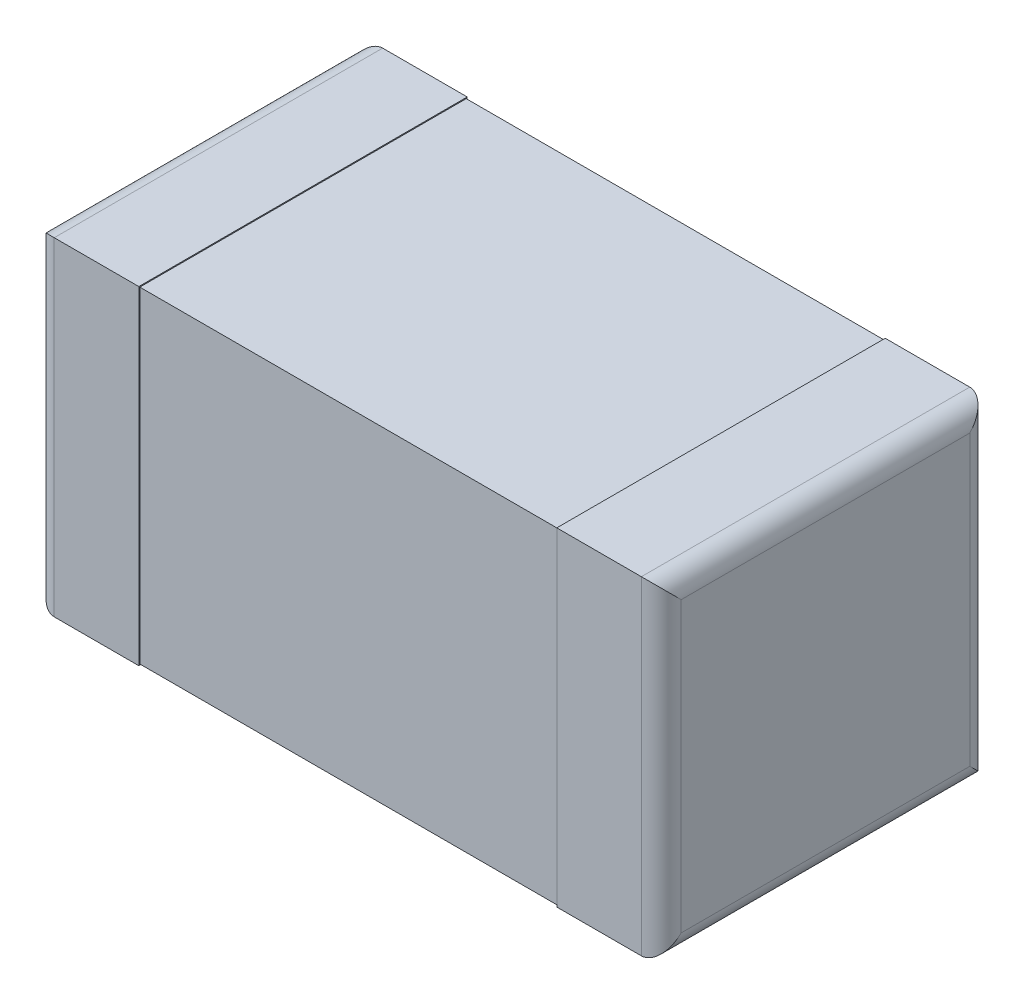
ISO-10303-21;
HEADER;
FILE_DESCRIPTION(('STEP AP214'),'2;1');
FILE_NAME('part.step','',(''),(''),'','','');
FILE_SCHEMA(('AUTOMOTIVE_DESIGN { 1 0 10303 214 1 1 1 1 }'));
ENDSEC;
DATA;
#1=APPLICATION_CONTEXT('core data for automotive mechanical design processes');
#2=APPLICATION_PROTOCOL_DEFINITION('international standard','automotive_design',2000,#1);
#3=PRODUCT_CONTEXT('',#1,'mechanical');
#4=PRODUCT('Part','Part','',(#3));
#5=PRODUCT_RELATED_PRODUCT_CATEGORY('part','',(#4));
#6=PRODUCT_DEFINITION_FORMATION('','',#4);
#7=PRODUCT_DEFINITION_CONTEXT('part definition',#1,'design');
#8=PRODUCT_DEFINITION('design','',#6,#7);
#9=PRODUCT_DEFINITION_SHAPE('','',#8);
#10=(LENGTH_UNIT() NAMED_UNIT(*) SI_UNIT(.MILLI.,.METRE.));
#11=(NAMED_UNIT(*) PLANE_ANGLE_UNIT() SI_UNIT($,.RADIAN.));
#12=(NAMED_UNIT(*) SI_UNIT($,.STERADIAN.) SOLID_ANGLE_UNIT());
#13=UNCERTAINTY_MEASURE_WITH_UNIT(LENGTH_MEASURE(1.E-05),#10,'distance_accuracy_value','');
#14=(GEOMETRIC_REPRESENTATION_CONTEXT(3) GLOBAL_UNCERTAINTY_ASSIGNED_CONTEXT((#13)) GLOBAL_UNIT_ASSIGNED_CONTEXT((#10,
#11,#12)) REPRESENTATION_CONTEXT('',''));
#15=CARTESIAN_POINT('',(0.,0.,0.));
#16=DIRECTION('',(0.,0.,1.));
#17=DIRECTION('',(1.,0.,0.));
#18=AXIS2_PLACEMENT_3D('',#15,#16,#17);
#19=CARTESIAN_POINT('',(0.,0.8382,0.8382));
#20=DIRECTION('',(1.,0.,0.));
#21=DIRECTION('',(0.,1.,0.));
#22=AXIS2_PLACEMENT_3D('',#19,#20,#21);
#23=PLANE('',#22);
#24=DIRECTION('',(0.,0.,-1.));
#25=VECTOR('',#24,1.);
#26=CARTESIAN_POINT('',(0.,0.0508,0.8382));
#27=LINE('',#26,#25);
#28=CARTESIAN_POINT('',(0.,0.0508,0.7874));
#29=VERTEX_POINT('',#28);
#30=CARTESIAN_POINT('',(0.,0.0508,0.0508));
#31=VERTEX_POINT('',#30);
#32=EDGE_CURVE('E194',#29,#31,#27,.T.);
#33=ORIENTED_EDGE('',*,*,#32,.F.);
#34=DIRECTION('',(0.,1.,0.));
#35=VECTOR('',#34,1.);
#36=CARTESIAN_POINT('',(0.,0.,0.7874));
#37=LINE('',#36,#35);
#38=CARTESIAN_POINT('',(0.,0.7874,0.7874));
#39=VERTEX_POINT('',#38);
#40=EDGE_CURVE('E153',#39,#29,#37,.F.);
#41=ORIENTED_EDGE('',*,*,#40,.F.);
#42=DIRECTION('',(0.,0.,-1.));
#43=VECTOR('',#42,1.);
#44=CARTESIAN_POINT('',(0.,0.7874,0.8382));
#45=LINE('',#44,#43);
#46=CARTESIAN_POINT('',(0.,0.7874,0.0508));
#47=VERTEX_POINT('',#46);
#48=EDGE_CURVE('E150',#47,#39,#45,.F.);
#49=ORIENTED_EDGE('',*,*,#48,.F.);
#50=DIRECTION('',(0.,-1.,0.));
#51=VECTOR('',#50,1.);
#52=CARTESIAN_POINT('',(0.,0.8382,0.0508));
#53=LINE('',#52,#51);
#54=EDGE_CURVE('E192',#31,#47,#53,.F.);
#55=ORIENTED_EDGE('',*,*,#54,.F.);
#56=EDGE_LOOP('',(#33,#41,#49,#55));
#57=FACE_BOUND('',#56,.T.);
#58=ADVANCED_FACE('F16',(#57),#23,.F.);
#59=CARTESIAN_POINT('',(1.6002,0.,0.8382));
#60=DIRECTION('',(-1.,0.,0.));
#61=DIRECTION('',(0.,0.,1.));
#62=AXIS2_PLACEMENT_3D('',#59,#60,#61);
#63=PLANE('',#62);
#64=DIRECTION('',(0.,0.,-1.));
#65=VECTOR('',#64,1.);
#66=CARTESIAN_POINT('',(1.6002,0.7874,0.8382));
#67=LINE('',#66,#65);
#68=CARTESIAN_POINT('',(1.6002,0.7874,0.7874));
#69=VERTEX_POINT('',#68);
#70=CARTESIAN_POINT('',(1.6002,0.7874,0.0508));
#71=VERTEX_POINT('',#70);
#72=EDGE_CURVE('E180',#69,#71,#67,.T.);
#73=ORIENTED_EDGE('',*,*,#72,.F.);
#74=DIRECTION('',(0.,-1.,0.));
#75=VECTOR('',#74,1.);
#76=CARTESIAN_POINT('',(1.6002,0.,0.7874));
#77=LINE('',#76,#75);
#78=CARTESIAN_POINT('',(1.6002,0.0508,0.7874));
#79=VERTEX_POINT('',#78);
#80=EDGE_CURVE('E184',#79,#69,#77,.F.);
#81=ORIENTED_EDGE('',*,*,#80,.F.);
#82=DIRECTION('',(0.,0.,-1.));
#83=VECTOR('',#82,1.);
#84=CARTESIAN_POINT('',(1.6002,0.0508,0.8382));
#85=LINE('',#84,#83);
#86=CARTESIAN_POINT('',(1.6002,0.0508,0.0508));
#87=VERTEX_POINT('',#86);
#88=EDGE_CURVE('E188',#87,#79,#85,.F.);
#89=ORIENTED_EDGE('',*,*,#88,.F.);
#90=DIRECTION('',(0.,1.,0.));
#91=VECTOR('',#90,1.);
#92=CARTESIAN_POINT('',(1.6002,0.,0.0508));
#93=LINE('',#92,#91);
#94=EDGE_CURVE('E137',#71,#87,#93,.F.);
#95=ORIENTED_EDGE('',*,*,#94,.F.);
#96=EDGE_LOOP('',(#73,#81,#89,#95));
#97=FACE_BOUND('',#96,.T.);
#98=ADVANCED_FACE('F381',(#97),#63,.F.);
#99=CARTESIAN_POINT('',(0.0508,0.7874,0.8382));
#100=DIRECTION('',(0.,0.,-1.));
#101=DIRECTION('',(-1.,0.,0.));
#102=AXIS2_PLACEMENT_3D('',#99,#100,#101);
#103=CYLINDRICAL_SURFACE('',#102,0.0508);
#104=CARTESIAN_POINT('',(0.0508,0.7874,0.7874));
#105=DIRECTION('',(0.,0.707106781186547,-0.707106781186547));
#106=DIRECTION('',(0.,0.707106781186547,0.707106781186547));
#107=AXIS2_PLACEMENT_3D('',#104,#105,#106);
#108=ELLIPSE('',#107,0.0718420489685532,0.0508);
#109=CARTESIAN_POINT('',(0.0508,0.8382,0.8382));
#110=VERTEX_POINT('',#109);
#111=EDGE_CURVE('E19',#110,#39,#108,.F.);
#112=ORIENTED_EDGE('',*,*,#111,.F.);
#113=DIRECTION('',(0.,0.,1.));
#114=VECTOR('',#113,1.);
#115=CARTESIAN_POINT('',(0.0507999999999999,0.8382,0.8382));
#116=LINE('',#115,#114);
#117=CARTESIAN_POINT('',(0.0508,0.8382,0.));
#118=VERTEX_POINT('',#117);
#119=EDGE_CURVE('E126',#110,#118,#116,.F.);
#120=ORIENTED_EDGE('',*,*,#119,.T.);
#121=CARTESIAN_POINT('',(0.0508,0.7874,0.0508));
#122=DIRECTION('',(0.,-0.707106781186547,-0.707106781186547));
#123=DIRECTION('',(0.,-0.707106781186547,0.707106781186547));
#124=AXIS2_PLACEMENT_3D('',#121,#122,#123);
#125=ELLIPSE('',#124,0.0718420489685532,0.0508);
#126=EDGE_CURVE('E193',#47,#118,#125,.T.);
#127=ORIENTED_EDGE('',*,*,#126,.F.);
#128=ORIENTED_EDGE('',*,*,#48,.T.);
#129=EDGE_LOOP('',(#112,#120,#127,#128));
#130=FACE_BOUND('',#129,.T.);
#131=ADVANCED_FACE('F149',(#130),#103,.T.);
#132=CARTESIAN_POINT('',(0.0508,0.,0.7874));
#133=DIRECTION('',(0.,1.,0.));
#134=DIRECTION('',(-1.,0.,0.));
#135=AXIS2_PLACEMENT_3D('',#132,#133,#134);
#136=CYLINDRICAL_SURFACE('',#135,0.0508);
#137=CARTESIAN_POINT('',(0.0508,0.0508,0.7874));
#138=DIRECTION('',(0.,-0.707106781186547,-0.707106781186547));
#139=DIRECTION('',(0.,0.707106781186547,-0.707106781186547));
#140=AXIS2_PLACEMENT_3D('',#137,#138,#139);
#141=ELLIPSE('',#140,0.0718420489685532,0.0508);
#142=CARTESIAN_POINT('',(0.0507999999999999,0.,0.8382));
#143=VERTEX_POINT('',#142);
#144=EDGE_CURVE('E156',#143,#29,#141,.T.);
#145=ORIENTED_EDGE('',*,*,#144,.F.);
#146=DIRECTION('',(0.,1.,0.));
#147=VECTOR('',#146,1.);
#148=CARTESIAN_POINT('',(0.0507999999999999,0.,0.8382));
#149=LINE('',#148,#147);
#150=EDGE_CURVE('E143',#110,#143,#149,.F.);
#151=ORIENTED_EDGE('',*,*,#150,.F.);
#152=ORIENTED_EDGE('',*,*,#111,.T.);
#153=ORIENTED_EDGE('',*,*,#40,.T.);
#154=EDGE_LOOP('',(#145,#151,#152,#153));
#155=FACE_BOUND('',#154,.T.);
#156=ADVANCED_FACE('F154',(#155),#136,.T.);
#157=CARTESIAN_POINT('',(0.0508,0.0508,0.8382));
#158=DIRECTION('',(0.,0.,-1.));
#159=DIRECTION('',(-1.,0.,0.));
#160=AXIS2_PLACEMENT_3D('',#157,#158,#159);
#161=CYLINDRICAL_SURFACE('',#160,0.0508);
#162=CARTESIAN_POINT('',(0.0508,0.0508,0.0508));
#163=DIRECTION('',(0.,-0.707106781186547,0.707106781186547));
#164=DIRECTION('',(0.,-0.707106781186547,-0.707106781186547));
#165=AXIS2_PLACEMENT_3D('',#162,#163,#164);
#166=ELLIPSE('',#165,0.0718420489685532,0.0508);
#167=CARTESIAN_POINT('',(0.0508,0.,0.));
#168=VERTEX_POINT('',#167);
#169=EDGE_CURVE('E189',#168,#31,#166,.F.);
#170=ORIENTED_EDGE('',*,*,#169,.F.);
#171=DIRECTION('',(0.,0.,1.));
#172=VECTOR('',#171,1.);
#173=CARTESIAN_POINT('',(0.0508,0.,0.8382));
#174=LINE('',#173,#172);
#175=EDGE_CURVE('E158',#168,#143,#174,.T.);
#176=ORIENTED_EDGE('',*,*,#175,.T.);
#177=ORIENTED_EDGE('',*,*,#144,.T.);
#178=ORIENTED_EDGE('',*,*,#32,.T.);
#179=EDGE_LOOP('',(#170,#176,#177,#178));
#180=FACE_BOUND('',#179,.T.);
#181=ADVANCED_FACE('F374',(#180),#161,.T.);
#182=CARTESIAN_POINT('',(0.0508,0.8382,0.0508));
#183=DIRECTION('',(0.,-1.,0.));
#184=DIRECTION('',(1.,0.,0.));
#185=AXIS2_PLACEMENT_3D('',#182,#183,#184);
#186=CYLINDRICAL_SURFACE('',#185,0.0508);
#187=ORIENTED_EDGE('',*,*,#169,.T.);
#188=ORIENTED_EDGE('',*,*,#54,.T.);
#189=ORIENTED_EDGE('',*,*,#126,.T.);
#190=DIRECTION('',(0.,1.,0.));
#191=VECTOR('',#190,1.);
#192=CARTESIAN_POINT('',(0.0507999999999999,0.,0.));
#193=LINE('',#192,#191);
#194=EDGE_CURVE('E213',#118,#168,#193,.F.);
#195=ORIENTED_EDGE('',*,*,#194,.T.);
#196=EDGE_LOOP('',(#187,#188,#189,#195));
#197=FACE_BOUND('',#196,.T.);
#198=ADVANCED_FACE('F370',(#197),#186,.T.);
#199=CARTESIAN_POINT('',(1.5494,0.0508,0.8382));
#200=DIRECTION('',(0.,0.,-1.));
#201=DIRECTION('',(-1.,0.,0.));
#202=AXIS2_PLACEMENT_3D('',#199,#200,#201);
#203=CYLINDRICAL_SURFACE('',#202,0.0508);
#204=CARTESIAN_POINT('',(1.5494,0.0508,0.7874));
#205=DIRECTION('',(0.,-0.707106781186547,-0.707106781186547));
#206=DIRECTION('',(0.,-0.707106781186547,0.707106781186547));
#207=AXIS2_PLACEMENT_3D('',#204,#205,#206);
#208=ELLIPSE('',#207,0.0718420489685532,0.0508);
#209=CARTESIAN_POINT('',(1.5494,0.,0.8382));
#210=VERTEX_POINT('',#209);
#211=EDGE_CURVE('E185',#210,#79,#208,.F.);
#212=ORIENTED_EDGE('',*,*,#211,.F.);
#213=DIRECTION('',(0.,0.,1.));
#214=VECTOR('',#213,1.);
#215=CARTESIAN_POINT('',(1.5494,0.,0.8382));
#216=LINE('',#215,#214);
#217=CARTESIAN_POINT('',(1.5494,0.,0.));
#218=VERTEX_POINT('',#217);
#219=EDGE_CURVE('E212',#210,#218,#216,.F.);
#220=ORIENTED_EDGE('',*,*,#219,.T.);
#221=CARTESIAN_POINT('',(1.5494,0.0508,0.0508));
#222=DIRECTION('',(0.,0.707106781186547,-0.707106781186547));
#223=DIRECTION('',(0.,0.707106781186547,0.707106781186547));
#224=AXIS2_PLACEMENT_3D('',#221,#222,#223);
#225=ELLIPSE('',#224,0.0718420489685532,0.0508);
#226=EDGE_CURVE('E178',#87,#218,#225,.T.);
#227=ORIENTED_EDGE('',*,*,#226,.F.);
#228=ORIENTED_EDGE('',*,*,#88,.T.);
#229=EDGE_LOOP('',(#212,#220,#227,#228));
#230=FACE_BOUND('',#229,.T.);
#231=ADVANCED_FACE('F366',(#230),#203,.T.);
#232=CARTESIAN_POINT('',(1.5494,0.,0.7874));
#233=DIRECTION('',(0.,-1.,0.));
#234=DIRECTION('',(0.,0.,-1.));
#235=AXIS2_PLACEMENT_3D('',#232,#233,#234);
#236=CYLINDRICAL_SURFACE('',#235,0.0508);
#237=CARTESIAN_POINT('',(1.5494,0.7874,0.7874));
#238=DIRECTION('',(0.,0.707106781186547,-0.707106781186547));
#239=DIRECTION('',(0.,-0.707106781186547,-0.707106781186547));
#240=AXIS2_PLACEMENT_3D('',#237,#238,#239);
#241=ELLIPSE('',#240,0.0718420489685532,0.0508);
#242=CARTESIAN_POINT('',(1.5494,0.8382,0.8382));
#243=VERTEX_POINT('',#242);
#244=EDGE_CURVE('E181',#243,#69,#241,.T.);
#245=ORIENTED_EDGE('',*,*,#244,.F.);
#246=DIRECTION('',(0.,1.,0.));
#247=VECTOR('',#246,1.);
#248=CARTESIAN_POINT('',(1.5494,0.,0.8382));
#249=LINE('',#248,#247);
#250=EDGE_CURVE('E233',#210,#243,#249,.T.);
#251=ORIENTED_EDGE('',*,*,#250,.F.);
#252=ORIENTED_EDGE('',*,*,#211,.T.);
#253=ORIENTED_EDGE('',*,*,#80,.T.);
#254=EDGE_LOOP('',(#245,#251,#252,#253));
#255=FACE_BOUND('',#254,.T.);
#256=ADVANCED_FACE('F362',(#255),#236,.T.);
#257=CARTESIAN_POINT('',(1.5494,0.7874,0.8382));
#258=DIRECTION('',(0.,0.,-1.));
#259=DIRECTION('',(-1.,0.,0.));
#260=AXIS2_PLACEMENT_3D('',#257,#258,#259);
#261=CYLINDRICAL_SURFACE('',#260,0.0508);
#262=CARTESIAN_POINT('',(1.5494,0.7874,0.0508));
#263=DIRECTION('',(0.,0.707106781186547,0.707106781186547));
#264=DIRECTION('',(0.,0.707106781186547,-0.707106781186547));
#265=AXIS2_PLACEMENT_3D('',#262,#263,#264);
#266=ELLIPSE('',#265,0.0718420489685532,0.0508);
#267=CARTESIAN_POINT('',(1.5494,0.8382,0.));
#268=VERTEX_POINT('',#267);
#269=EDGE_CURVE('E175',#268,#71,#266,.F.);
#270=ORIENTED_EDGE('',*,*,#269,.F.);
#271=DIRECTION('',(0.,0.,1.));
#272=VECTOR('',#271,1.);
#273=CARTESIAN_POINT('',(1.5494,0.8382,0.8382));
#274=LINE('',#273,#272);
#275=EDGE_CURVE('E236',#268,#243,#274,.T.);
#276=ORIENTED_EDGE('',*,*,#275,.T.);
#277=ORIENTED_EDGE('',*,*,#244,.T.);
#278=ORIENTED_EDGE('',*,*,#72,.T.);
#279=EDGE_LOOP('',(#270,#276,#277,#278));
#280=FACE_BOUND('',#279,.T.);
#281=ADVANCED_FACE('F358',(#280),#261,.T.);
#282=CARTESIAN_POINT('',(1.5494,0.,0.0508));
#283=DIRECTION('',(0.,1.,0.));
#284=DIRECTION('',(0.,0.,1.));
#285=AXIS2_PLACEMENT_3D('',#282,#283,#284);
#286=CYLINDRICAL_SURFACE('',#285,0.0508);
#287=ORIENTED_EDGE('',*,*,#269,.T.);
#288=ORIENTED_EDGE('',*,*,#94,.T.);
#289=ORIENTED_EDGE('',*,*,#226,.T.);
#290=DIRECTION('',(0.,1.,0.));
#291=VECTOR('',#290,1.);
#292=CARTESIAN_POINT('',(1.5494,0.,0.));
#293=LINE('',#292,#291);
#294=EDGE_CURVE('E260',#218,#268,#293,.T.);
#295=ORIENTED_EDGE('',*,*,#294,.T.);
#296=EDGE_LOOP('',(#287,#288,#289,#295));
#297=FACE_BOUND('',#296,.T.);
#298=ADVANCED_FACE('F355',(#297),#286,.T.);
#299=CARTESIAN_POINT('',(1.6002,0.8382,0.8382));
#300=DIRECTION('',(0.,-1.,0.));
#301=DIRECTION('',(1.,0.,0.));
#302=AXIS2_PLACEMENT_3D('',#299,#300,#301);
#303=PLANE('',#302);
#304=ORIENTED_EDGE('',*,*,#119,.F.);
#305=DIRECTION('',(1.,0.,0.));
#306=VECTOR('',#305,1.);
#307=CARTESIAN_POINT('',(0.,0.8382,0.8382));
#308=LINE('',#307,#306);
#309=CARTESIAN_POINT('',(0.2667,0.8382,0.8382));
#310=VERTEX_POINT('',#309);
#311=EDGE_CURVE('E130',#310,#110,#308,.F.);
#312=ORIENTED_EDGE('',*,*,#311,.F.);
#313=DIRECTION('',(0.,0.,1.));
#314=VECTOR('',#313,1.);
#315=CARTESIAN_POINT('',(0.2667,0.8382,0.83566));
#316=LINE('',#315,#314);
#317=CARTESIAN_POINT('',(0.2667,0.8382,0.));
#318=VERTEX_POINT('',#317);
#319=EDGE_CURVE('E171',#318,#310,#316,.T.);
#320=ORIENTED_EDGE('',*,*,#319,.F.);
#321=DIRECTION('',(1.,0.,0.));
#322=VECTOR('',#321,1.);
#323=CARTESIAN_POINT('',(0.,0.8382,0.));
#324=LINE('',#323,#322);
#325=EDGE_CURVE('E132',#318,#118,#324,.F.);
#326=ORIENTED_EDGE('',*,*,#325,.T.);
#327=EDGE_LOOP('',(#304,#312,#320,#326));
#328=FACE_BOUND('',#327,.T.);
#329=ADVANCED_FACE('F128',(#328),#303,.F.);
#330=CARTESIAN_POINT('',(0.,0.,0.8382));
#331=DIRECTION('',(0.,0.,1.));
#332=DIRECTION('',(1.,0.,0.));
#333=AXIS2_PLACEMENT_3D('',#330,#331,#332);
#334=PLANE('',#333);
#335=DIRECTION('',(1.,0.,0.));
#336=VECTOR('',#335,1.);
#337=CARTESIAN_POINT('',(0.,0.,0.8382));
#338=LINE('',#337,#336);
#339=CARTESIAN_POINT('',(0.2667,0.,0.8382));
#340=VERTEX_POINT('',#339);
#341=EDGE_CURVE('E161',#143,#340,#338,.T.);
#342=ORIENTED_EDGE('',*,*,#341,.T.);
#343=DIRECTION('',(0.,1.,0.));
#344=VECTOR('',#343,1.);
#345=CARTESIAN_POINT('',(0.2667,0.,0.8382));
#346=LINE('',#345,#344);
#347=EDGE_CURVE('E145',#310,#340,#346,.F.);
#348=ORIENTED_EDGE('',*,*,#347,.F.);
#349=ORIENTED_EDGE('',*,*,#311,.T.);
#350=ORIENTED_EDGE('',*,*,#150,.T.);
#351=EDGE_LOOP('',(#342,#348,#349,#350));
#352=FACE_BOUND('',#351,.T.);
#353=ADVANCED_FACE('F141',(#352),#334,.T.);
#354=CARTESIAN_POINT('',(0.,0.,0.8382));
#355=DIRECTION('',(0.,1.,0.));
#356=DIRECTION('',(0.,0.,1.));
#357=AXIS2_PLACEMENT_3D('',#354,#355,#356);
#358=PLANE('',#357);
#359=ORIENTED_EDGE('',*,*,#175,.F.);
#360=DIRECTION('',(1.,0.,0.));
#361=VECTOR('',#360,1.);
#362=CARTESIAN_POINT('',(0.,0.,0.));
#363=LINE('',#362,#361);
#364=CARTESIAN_POINT('',(0.2667,0.,0.));
#365=VERTEX_POINT('',#364);
#366=EDGE_CURVE('E209',#168,#365,#363,.T.);
#367=ORIENTED_EDGE('',*,*,#366,.T.);
#368=DIRECTION('',(0.,0.,1.));
#369=VECTOR('',#368,1.);
#370=CARTESIAN_POINT('',(0.2667,0.,0.83566));
#371=LINE('',#370,#369);
#372=EDGE_CURVE('E170',#340,#365,#371,.F.);
#373=ORIENTED_EDGE('',*,*,#372,.F.);
#374=ORIENTED_EDGE('',*,*,#341,.F.);
#375=EDGE_LOOP('',(#359,#367,#373,#374));
#376=FACE_BOUND('',#375,.T.);
#377=ADVANCED_FACE('F346',(#376),#358,.F.);
#378=CARTESIAN_POINT('',(0.,0.,0.));
#379=DIRECTION('',(0.,0.,1.));
#380=DIRECTION('',(1.,0.,0.));
#381=AXIS2_PLACEMENT_3D('',#378,#379,#380);
#382=PLANE('',#381);
#383=ORIENTED_EDGE('',*,*,#194,.F.);
#384=ORIENTED_EDGE('',*,*,#325,.F.);
#385=DIRECTION('',(0.,1.,0.));
#386=VECTOR('',#385,1.);
#387=CARTESIAN_POINT('',(0.2667,0.,0.));
#388=LINE('',#387,#386);
#389=EDGE_CURVE('E205',#365,#318,#388,.T.);
#390=ORIENTED_EDGE('',*,*,#389,.F.);
#391=ORIENTED_EDGE('',*,*,#366,.F.);
#392=EDGE_LOOP('',(#383,#384,#390,#391));
#393=FACE_BOUND('',#392,.T.);
#394=ADVANCED_FACE('F342',(#393),#382,.F.);
#395=CARTESIAN_POINT('',(0.2667,1.99143127423469,0.0025399999999999));
#396=DIRECTION('',(0.,0.,-1.));
#397=DIRECTION('',(-1.,0.,0.));
#398=AXIS2_PLACEMENT_3D('',#395,#396,#397);
#399=PLANE('',#398);
#400=DIRECTION('',(1.,0.,0.));
#401=VECTOR('',#400,1.);
#402=CARTESIAN_POINT('',(0.2667,0.83566,0.00253999999999988));
#403=LINE('',#402,#401);
#404=CARTESIAN_POINT('',(0.2667,0.83566,0.00253999999999988));
#405=VERTEX_POINT('',#404);
#406=CARTESIAN_POINT('',(1.3335,0.83566,0.00253999999999989));
#407=VERTEX_POINT('',#406);
#408=EDGE_CURVE('E277',#405,#407,#403,.T.);
#409=ORIENTED_EDGE('',*,*,#408,.T.);
#410=DIRECTION('',(0.,1.,0.));
#411=VECTOR('',#410,1.);
#412=CARTESIAN_POINT('',(1.3335,0.8382,0.00253999999999988));
#413=LINE('',#412,#411);
#414=CARTESIAN_POINT('',(1.3335,0.00254000000000005,0.00253999999999989));
#415=VERTEX_POINT('',#414);
#416=EDGE_CURVE('E280',#415,#407,#413,.T.);
#417=ORIENTED_EDGE('',*,*,#416,.F.);
#418=DIRECTION('',(-1.,0.,0.));
#419=VECTOR('',#418,1.);
#420=CARTESIAN_POINT('',(1.3335,0.00254000000000001,0.00253999999999988));
#421=LINE('',#420,#419);
#422=CARTESIAN_POINT('',(0.2667,0.00254000000000004,0.00253999999999989));
#423=VERTEX_POINT('',#422);
#424=EDGE_CURVE('E259',#415,#423,#421,.T.);
#425=ORIENTED_EDGE('',*,*,#424,.T.);
#426=DIRECTION('',(0.,1.,0.));
#427=VECTOR('',#426,1.);
#428=CARTESIAN_POINT('',(0.2667,0.,0.00253999999999988));
#429=LINE('',#428,#427);
#430=EDGE_CURVE('E271',#405,#423,#429,.F.);
#431=ORIENTED_EDGE('',*,*,#430,.F.);
#432=EDGE_LOOP('',(#409,#417,#425,#431));
#433=FACE_BOUND('',#432,.T.);
#434=ADVANCED_FACE('F338',(#433),#399,.T.);
#435=CARTESIAN_POINT('',(0.,0.,0.8382));
#436=DIRECTION('',(0.,1.,0.));
#437=DIRECTION('',(0.,0.,1.));
#438=AXIS2_PLACEMENT_3D('',#435,#436,#437);
#439=PLANE('',#438);
#440=ORIENTED_EDGE('',*,*,#219,.F.);
#441=DIRECTION('',(1.,0.,0.));
#442=VECTOR('',#441,1.);
#443=CARTESIAN_POINT('',(0.,0.,0.8382));
#444=LINE('',#443,#442);
#445=CARTESIAN_POINT('',(1.3335,0.,0.8382));
#446=VERTEX_POINT('',#445);
#447=EDGE_CURVE('E230',#446,#210,#444,.T.);
#448=ORIENTED_EDGE('',*,*,#447,.F.);
#449=DIRECTION('',(0.,0.,1.));
#450=VECTOR('',#449,1.);
#451=CARTESIAN_POINT('',(1.3335,0.,0.83566));
#452=LINE('',#451,#450);
#453=CARTESIAN_POINT('',(1.3335,0.,0.));
#454=VERTEX_POINT('',#453);
#455=EDGE_CURVE('E227',#454,#446,#452,.T.);
#456=ORIENTED_EDGE('',*,*,#455,.F.);
#457=DIRECTION('',(1.,0.,0.));
#458=VECTOR('',#457,1.);
#459=CARTESIAN_POINT('',(0.,0.,0.));
#460=LINE('',#459,#458);
#461=EDGE_CURVE('E240',#454,#218,#460,.T.);
#462=ORIENTED_EDGE('',*,*,#461,.T.);
#463=EDGE_LOOP('',(#440,#448,#456,#462));
#464=FACE_BOUND('',#463,.T.);
#465=ADVANCED_FACE('F334',(#464),#439,.F.);
#466=CARTESIAN_POINT('',(0.,0.,0.8382));
#467=DIRECTION('',(0.,0.,1.));
#468=DIRECTION('',(1.,0.,0.));
#469=AXIS2_PLACEMENT_3D('',#466,#467,#468);
#470=PLANE('',#469);
#471=DIRECTION('',(1.,0.,0.));
#472=VECTOR('',#471,1.);
#473=CARTESIAN_POINT('',(1.6002,0.8382,0.8382));
#474=LINE('',#473,#472);
#475=CARTESIAN_POINT('',(1.3335,0.8382,0.8382));
#476=VERTEX_POINT('',#475);
#477=EDGE_CURVE('E237',#243,#476,#474,.F.);
#478=ORIENTED_EDGE('',*,*,#477,.T.);
#479=DIRECTION('',(0.,1.,0.));
#480=VECTOR('',#479,1.);
#481=CARTESIAN_POINT('',(1.3335,0.8382,0.8382));
#482=LINE('',#481,#480);
#483=EDGE_CURVE('E224',#446,#476,#482,.T.);
#484=ORIENTED_EDGE('',*,*,#483,.F.);
#485=ORIENTED_EDGE('',*,*,#447,.T.);
#486=ORIENTED_EDGE('',*,*,#250,.T.);
#487=EDGE_LOOP('',(#478,#484,#485,#486));
#488=FACE_BOUND('',#487,.T.);
#489=ADVANCED_FACE('F330',(#488),#470,.T.);
#490=CARTESIAN_POINT('',(1.6002,0.8382,0.8382));
#491=DIRECTION('',(0.,-1.,0.));
#492=DIRECTION('',(1.,0.,0.));
#493=AXIS2_PLACEMENT_3D('',#490,#491,#492);
#494=PLANE('',#493);
#495=ORIENTED_EDGE('',*,*,#275,.F.);
#496=DIRECTION('',(1.,0.,0.));
#497=VECTOR('',#496,1.);
#498=CARTESIAN_POINT('',(0.,0.8382,0.));
#499=LINE('',#498,#497);
#500=CARTESIAN_POINT('',(1.3335,0.8382,0.));
#501=VERTEX_POINT('',#500);
#502=EDGE_CURVE('E256',#268,#501,#499,.F.);
#503=ORIENTED_EDGE('',*,*,#502,.T.);
#504=DIRECTION('',(0.,0.,1.));
#505=VECTOR('',#504,1.);
#506=CARTESIAN_POINT('',(1.3335,0.8382,0.83566));
#507=LINE('',#506,#505);
#508=EDGE_CURVE('E226',#476,#501,#507,.F.);
#509=ORIENTED_EDGE('',*,*,#508,.F.);
#510=ORIENTED_EDGE('',*,*,#477,.F.);
#511=EDGE_LOOP('',(#495,#503,#509,#510));
#512=FACE_BOUND('',#511,.T.);
#513=ADVANCED_FACE('F326',(#512),#494,.F.);
#514=CARTESIAN_POINT('',(0.,0.,0.));
#515=DIRECTION('',(0.,0.,1.));
#516=DIRECTION('',(1.,0.,0.));
#517=AXIS2_PLACEMENT_3D('',#514,#515,#516);
#518=PLANE('',#517);
#519=ORIENTED_EDGE('',*,*,#294,.F.);
#520=ORIENTED_EDGE('',*,*,#461,.F.);
#521=DIRECTION('',(0.,1.,0.));
#522=VECTOR('',#521,1.);
#523=CARTESIAN_POINT('',(1.3335,0.8382,0.));
#524=LINE('',#523,#522);
#525=EDGE_CURVE('E248',#501,#454,#524,.F.);
#526=ORIENTED_EDGE('',*,*,#525,.F.);
#527=ORIENTED_EDGE('',*,*,#502,.F.);
#528=EDGE_LOOP('',(#519,#520,#526,#527));
#529=FACE_BOUND('',#528,.T.);
#530=ADVANCED_FACE('F323',(#529),#518,.F.);
#531=CARTESIAN_POINT('',(1.3335,0.00254000000000001,-1.15577127423469));
#532=DIRECTION('',(0.,1.,0.));
#533=DIRECTION('',(-1.,0.,0.));
#534=AXIS2_PLACEMENT_3D('',#531,#532,#533);
#535=PLANE('',#534);
#536=DIRECTION('',(0.,0.,1.));
#537=VECTOR('',#536,1.);
#538=CARTESIAN_POINT('',(1.3335,0.00253999999999999,0.83566));
#539=LINE('',#538,#537);
#540=CARTESIAN_POINT('',(1.3335,0.00254,0.83566));
#541=VERTEX_POINT('',#540);
#542=EDGE_CURVE('E245',#541,#415,#539,.F.);
#543=ORIENTED_EDGE('',*,*,#542,.F.);
#544=DIRECTION('',(-1.,0.,0.));
#545=VECTOR('',#544,1.);
#546=CARTESIAN_POINT('',(0.,0.00254000000000001,0.83566));
#547=LINE('',#546,#545);
#548=CARTESIAN_POINT('',(0.2667,0.00253999999999996,0.83566));
#549=VERTEX_POINT('',#548);
#550=EDGE_CURVE('E251',#541,#549,#547,.T.);
#551=ORIENTED_EDGE('',*,*,#550,.T.);
#552=DIRECTION('',(0.,0.,1.));
#553=VECTOR('',#552,1.);
#554=CARTESIAN_POINT('',(0.2667,0.00254000000000009,0.83566));
#555=LINE('',#554,#553);
#556=EDGE_CURVE('E202',#423,#549,#555,.T.);
#557=ORIENTED_EDGE('',*,*,#556,.F.);
#558=ORIENTED_EDGE('',*,*,#424,.F.);
#559=EDGE_LOOP('',(#543,#551,#557,#558));
#560=FACE_BOUND('',#559,.T.);
#561=ADVANCED_FACE('F304',(#560),#535,.F.);
#562=CARTESIAN_POINT('',(0.2667,0.,0.83566));
#563=DIRECTION('',(1.,0.,0.));
#564=DIRECTION('',(0.,1.,0.));
#565=AXIS2_PLACEMENT_3D('',#562,#563,#564);
#566=PLANE('',#565);
#567=ORIENTED_EDGE('',*,*,#372,.T.);
#568=ORIENTED_EDGE('',*,*,#389,.T.);
#569=ORIENTED_EDGE('',*,*,#319,.T.);
#570=ORIENTED_EDGE('',*,*,#347,.T.);
#571=EDGE_LOOP('',(#567,#568,#569,#570));
#572=FACE_BOUND('',#571,.T.);
#573=ORIENTED_EDGE('',*,*,#556,.T.);
#574=DIRECTION('',(0.,1.,0.));
#575=VECTOR('',#574,1.);
#576=CARTESIAN_POINT('',(0.2667,0.,0.83566));
#577=LINE('',#576,#575);
#578=CARTESIAN_POINT('',(0.2667,0.83566,0.83566));
#579=VERTEX_POINT('',#578);
#580=EDGE_CURVE('E288',#549,#579,#577,.T.);
#581=ORIENTED_EDGE('',*,*,#580,.T.);
#582=DIRECTION('',(0.,0.,-1.));
#583=VECTOR('',#582,1.);
#584=CARTESIAN_POINT('',(0.2667,0.83566,-1.15577127423469));
#585=LINE('',#584,#583);
#586=EDGE_CURVE('E207',#579,#405,#585,.T.);
#587=ORIENTED_EDGE('',*,*,#586,.T.);
#588=ORIENTED_EDGE('',*,*,#430,.T.);
#589=EDGE_LOOP('',(#573,#581,#587,#588));
#590=FACE_BOUND('',#589,.T.);
#591=ADVANCED_FACE('F300',(#572,#590),#566,.T.);
#592=CARTESIAN_POINT('',(0.2667,0.83566,-1.15577127423469));
#593=DIRECTION('',(0.,-1.,0.));
#594=DIRECTION('',(0.,0.,-1.));
#595=AXIS2_PLACEMENT_3D('',#592,#593,#594);
#596=PLANE('',#595);
#597=ORIENTED_EDGE('',*,*,#586,.F.);
#598=DIRECTION('',(-1.,0.,0.));
#599=VECTOR('',#598,1.);
#600=CARTESIAN_POINT('',(0.,0.83566,0.83566));
#601=LINE('',#600,#599);
#602=CARTESIAN_POINT('',(1.3335,0.83566,0.83566));
#603=VERTEX_POINT('',#602);
#604=EDGE_CURVE('E25',#579,#603,#601,.F.);
#605=ORIENTED_EDGE('',*,*,#604,.T.);
#606=DIRECTION('',(0.,0.,1.));
#607=VECTOR('',#606,1.);
#608=CARTESIAN_POINT('',(1.3335,0.83566,0.83566));
#609=LINE('',#608,#607);
#610=EDGE_CURVE('E33',#407,#603,#609,.T.);
#611=ORIENTED_EDGE('',*,*,#610,.F.);
#612=ORIENTED_EDGE('',*,*,#408,.F.);
#613=EDGE_LOOP('',(#597,#605,#611,#612));
#614=FACE_BOUND('',#613,.T.);
#615=ADVANCED_FACE('F294',(#614),#596,.F.);
#616=CARTESIAN_POINT('',(1.3335,0.8382,0.83566));
#617=DIRECTION('',(-1.,0.,0.));
#618=DIRECTION('',(0.,0.,1.));
#619=AXIS2_PLACEMENT_3D('',#616,#617,#618);
#620=PLANE('',#619);
#621=ORIENTED_EDGE('',*,*,#508,.T.);
#622=ORIENTED_EDGE('',*,*,#525,.T.);
#623=ORIENTED_EDGE('',*,*,#455,.T.);
#624=ORIENTED_EDGE('',*,*,#483,.T.);
#625=EDGE_LOOP('',(#621,#622,#623,#624));
#626=FACE_BOUND('',#625,.T.);
#627=DIRECTION('',(0.,1.,0.));
#628=VECTOR('',#627,1.);
#629=CARTESIAN_POINT('',(1.3335,0.,0.83566));
#630=LINE('',#629,#628);
#631=EDGE_CURVE('E11',#603,#541,#630,.F.);
#632=ORIENTED_EDGE('',*,*,#631,.T.);
#633=ORIENTED_EDGE('',*,*,#542,.T.);
#634=ORIENTED_EDGE('',*,*,#416,.T.);
#635=ORIENTED_EDGE('',*,*,#610,.T.);
#636=EDGE_LOOP('',(#632,#633,#634,#635));
#637=FACE_BOUND('',#636,.T.);
#638=ADVANCED_FACE('F306',(#626,#637),#620,.T.);
#639=CARTESIAN_POINT('',(0.,0.,0.83566));
#640=DIRECTION('',(0.,0.,-1.));
#641=DIRECTION('',(-1.,0.,0.));
#642=AXIS2_PLACEMENT_3D('',#639,#640,#641);
#643=PLANE('',#642);
#644=ORIENTED_EDGE('',*,*,#604,.F.);
#645=ORIENTED_EDGE('',*,*,#580,.F.);
#646=ORIENTED_EDGE('',*,*,#550,.F.);
#647=ORIENTED_EDGE('',*,*,#631,.F.);
#648=EDGE_LOOP('',(#644,#645,#646,#647));
#649=FACE_BOUND('',#648,.T.);
#650=ADVANCED_FACE('F298',(#649),#643,.F.);
#651=CLOSED_SHELL('',(#58,#98,#131,#156,#181,#198,#231,#256,#281,#298,#329,#353,#377,#394,#434,
#465,#489,#513,#530,#561,#591,#615,#638,#650));
#652=MANIFOLD_SOLID_BREP('B1',#651);
#653=ADVANCED_BREP_SHAPE_REPRESENTATION('',(#18,#652),#14);
#654=SHAPE_DEFINITION_REPRESENTATION(#9,#653);
ENDSEC;
END-ISO-10303-21;
